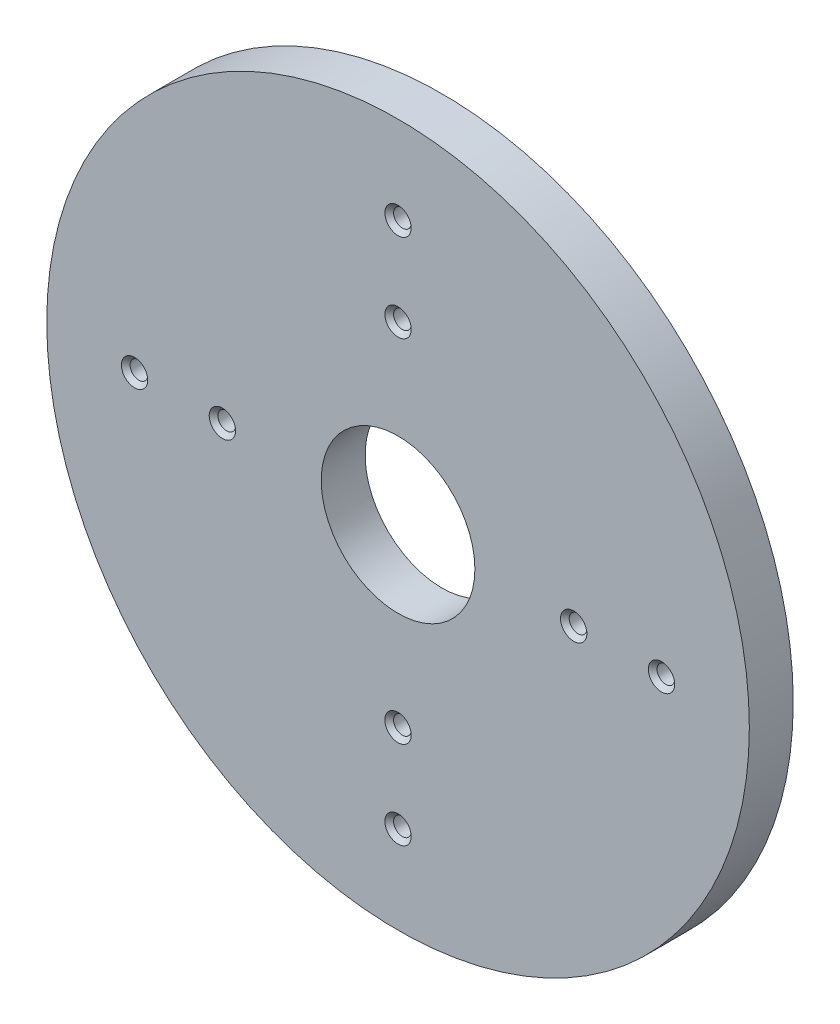
ISO-10303-21;
HEADER;
FILE_DESCRIPTION(('STEP AP214'),'2;1');
FILE_NAME('part.step','',(''),(''),'','','');
FILE_SCHEMA(('AUTOMOTIVE_DESIGN { 1 0 10303 214 1 1 1 1 }'));
ENDSEC;
DATA;
#1=APPLICATION_CONTEXT('core data for automotive mechanical design processes');
#2=APPLICATION_PROTOCOL_DEFINITION('international standard','automotive_design',2000,#1);
#3=PRODUCT_CONTEXT('',#1,'mechanical');
#4=PRODUCT('Part','Part','',(#3));
#5=PRODUCT_RELATED_PRODUCT_CATEGORY('part','',(#4));
#6=PRODUCT_DEFINITION_FORMATION('','',#4);
#7=PRODUCT_DEFINITION_CONTEXT('part definition',#1,'design');
#8=PRODUCT_DEFINITION('design','',#6,#7);
#9=PRODUCT_DEFINITION_SHAPE('','',#8);
#10=(LENGTH_UNIT() NAMED_UNIT(*) SI_UNIT(.MILLI.,.METRE.));
#11=(NAMED_UNIT(*) PLANE_ANGLE_UNIT() SI_UNIT($,.RADIAN.));
#12=(NAMED_UNIT(*) SI_UNIT($,.STERADIAN.) SOLID_ANGLE_UNIT());
#13=UNCERTAINTY_MEASURE_WITH_UNIT(LENGTH_MEASURE(1.E-05),#10,'distance_accuracy_value','');
#14=(GEOMETRIC_REPRESENTATION_CONTEXT(3) GLOBAL_UNCERTAINTY_ASSIGNED_CONTEXT((#13)) GLOBAL_UNIT_ASSIGNED_CONTEXT((#10,
#11,#12)) REPRESENTATION_CONTEXT('',''));
#15=CARTESIAN_POINT('',(0.,0.,0.));
#16=DIRECTION('',(0.,0.,1.));
#17=DIRECTION('',(1.,0.,0.));
#18=AXIS2_PLACEMENT_3D('',#15,#16,#17);
#19=CARTESIAN_POINT('',(0.,0.,12.7));
#20=DIRECTION('',(0.,0.,1.));
#21=DIRECTION('',(1.,0.,0.));
#22=AXIS2_PLACEMENT_3D('',#19,#20,#21);
#23=PLANE('',#22);
#24=CARTESIAN_POINT('',(0.,76.2,12.7));
#25=DIRECTION('',(0.,0.,1.));
#26=DIRECTION('',(1.,0.,0.));
#27=AXIS2_PLACEMENT_3D('',#24,#25,#26);
#28=CIRCLE('',#27,3.81);
#29=CARTESIAN_POINT('',(3.81,76.2,12.7));
#30=VERTEX_POINT('',#29);
#31=EDGE_CURVE('E143',#30,#30,#28,.T.);
#32=ORIENTED_EDGE('',*,*,#31,.F.);
#33=EDGE_LOOP('',(#32));
#34=FACE_BOUND('',#33,.T.);
#35=CARTESIAN_POINT('',(0.,50.8,12.7));
#36=DIRECTION('',(0.,0.,1.));
#37=DIRECTION('',(1.,0.,0.));
#38=AXIS2_PLACEMENT_3D('',#35,#36,#37);
#39=CIRCLE('',#38,3.81);
#40=CARTESIAN_POINT('',(3.81,50.8,12.7));
#41=VERTEX_POINT('',#40);
#42=EDGE_CURVE('E131',#41,#41,#39,.T.);
#43=ORIENTED_EDGE('',*,*,#42,.F.);
#44=EDGE_LOOP('',(#43));
#45=FACE_BOUND('',#44,.T.);
#46=CARTESIAN_POINT('',(76.2000000000014,1.43604633188994E-12,12.7));
#47=DIRECTION('',(0.,0.,1.));
#48=DIRECTION('',(1.,0.,0.));
#49=AXIS2_PLACEMENT_3D('',#46,#47,#48);
#50=CIRCLE('',#49,3.80999999999999);
#51=CARTESIAN_POINT('',(80.0100000000014,1.43604633188994E-12,12.7));
#52=VERTEX_POINT('',#51);
#53=EDGE_CURVE('E119',#52,#52,#50,.T.);
#54=ORIENTED_EDGE('',*,*,#53,.F.);
#55=EDGE_LOOP('',(#54));
#56=FACE_BOUND('',#55,.T.);
#57=CARTESIAN_POINT('',(50.8000000000014,1.43449103045502E-12,12.7));
#58=DIRECTION('',(0.,0.,1.));
#59=DIRECTION('',(1.,0.,0.));
#60=AXIS2_PLACEMENT_3D('',#57,#58,#59);
#61=CIRCLE('',#60,3.81);
#62=CARTESIAN_POINT('',(54.6100000000014,1.43449103045502E-12,12.7));
#63=VERTEX_POINT('',#62);
#64=EDGE_CURVE('E107',#63,#63,#61,.T.);
#65=ORIENTED_EDGE('',*,*,#64,.F.);
#66=EDGE_LOOP('',(#65));
#67=FACE_BOUND('',#66,.T.);
#68=CARTESIAN_POINT('',(2.87209266377988E-12,-76.2,12.7));
#69=DIRECTION('',(0.,0.,1.));
#70=DIRECTION('',(1.,0.,0.));
#71=AXIS2_PLACEMENT_3D('',#68,#69,#70);
#72=CIRCLE('',#71,3.81);
#73=CARTESIAN_POINT('',(3.81000000000287,-76.2,12.7));
#74=VERTEX_POINT('',#73);
#75=EDGE_CURVE('E95',#74,#74,#72,.T.);
#76=ORIENTED_EDGE('',*,*,#75,.F.);
#77=EDGE_LOOP('',(#76));
#78=FACE_BOUND('',#77,.T.);
#79=CARTESIAN_POINT('',(2.86898206091004E-12,-50.8,12.7));
#80=DIRECTION('',(0.,0.,1.));
#81=DIRECTION('',(1.,0.,0.));
#82=AXIS2_PLACEMENT_3D('',#79,#80,#81);
#83=CIRCLE('',#82,3.81);
#84=CARTESIAN_POINT('',(3.81000000000287,-50.8,12.7));
#85=VERTEX_POINT('',#84);
#86=EDGE_CURVE('E83',#85,#85,#83,.T.);
#87=ORIENTED_EDGE('',*,*,#86,.F.);
#88=EDGE_LOOP('',(#87));
#89=FACE_BOUND('',#88,.T.);
#90=CARTESIAN_POINT('',(-76.1999999999986,-1.42671452328043E-12,12.7));
#91=DIRECTION('',(0.,0.,1.));
#92=DIRECTION('',(1.,0.,0.));
#93=AXIS2_PLACEMENT_3D('',#90,#91,#92);
#94=CIRCLE('',#93,3.80999999999999);
#95=CARTESIAN_POINT('',(-72.3899999999986,-1.42671452328043E-12,12.7));
#96=VERTEX_POINT('',#95);
#97=EDGE_CURVE('E71',#96,#96,#94,.T.);
#98=ORIENTED_EDGE('',*,*,#97,.F.);
#99=EDGE_LOOP('',(#98));
#100=FACE_BOUND('',#99,.T.);
#101=CARTESIAN_POINT('',(-50.7999999999986,-1.42826982471535E-12,12.7));
#102=DIRECTION('',(0.,0.,1.));
#103=DIRECTION('',(1.,0.,0.));
#104=AXIS2_PLACEMENT_3D('',#101,#102,#103);
#105=CIRCLE('',#104,3.81);
#106=CARTESIAN_POINT('',(-46.9899999999986,-1.42826982471535E-12,12.7));
#107=VERTEX_POINT('',#106);
#108=EDGE_CURVE('E59',#107,#107,#105,.T.);
#109=ORIENTED_EDGE('',*,*,#108,.F.);
#110=EDGE_LOOP('',(#109));
#111=FACE_BOUND('',#110,.T.);
#112=CARTESIAN_POINT('',(0.,0.,12.7));
#113=DIRECTION('',(0.,0.,1.));
#114=DIRECTION('',(1.,0.,0.));
#115=AXIS2_PLACEMENT_3D('',#112,#113,#114);
#116=CIRCLE('',#115,101.6);
#117=CARTESIAN_POINT('',(101.6,0.,12.7));
#118=VERTEX_POINT('',#117);
#119=EDGE_CURVE('E10',#118,#118,#116,.T.);
#120=ORIENTED_EDGE('',*,*,#119,.T.);
#121=EDGE_LOOP('',(#120));
#122=FACE_BOUND('',#121,.T.);
#123=CARTESIAN_POINT('',(0.,0.,12.7));
#124=DIRECTION('',(0.,0.,1.));
#125=DIRECTION('',(1.,0.,0.));
#126=AXIS2_PLACEMENT_3D('',#123,#124,#125);
#127=CIRCLE('',#126,22.225);
#128=CARTESIAN_POINT('',(22.225,0.,12.7));
#129=VERTEX_POINT('',#128);
#130=EDGE_CURVE('E46',#129,#129,#127,.T.);
#131=ORIENTED_EDGE('',*,*,#130,.F.);
#132=EDGE_LOOP('',(#131));
#133=FACE_BOUND('',#132,.T.);
#134=ADVANCED_FACE('F35',(#34,#45,#56,#67,#78,#89,#100,#111,#122,#133),#23,.T.);
#135=CARTESIAN_POINT('',(0.,0.,0.));
#136=DIRECTION('',(0.,0.,1.));
#137=DIRECTION('',(1.,0.,0.));
#138=AXIS2_PLACEMENT_3D('',#135,#136,#137);
#139=PLANE('',#138);
#140=CARTESIAN_POINT('',(0.,76.2,0.));
#141=DIRECTION('',(0.,0.,1.));
#142=DIRECTION('',(1.,0.,0.));
#143=AXIS2_PLACEMENT_3D('',#140,#141,#142);
#144=CIRCLE('',#143,3.81);
#145=CARTESIAN_POINT('',(3.81,76.2,0.));
#146=VERTEX_POINT('',#145);
#147=EDGE_CURVE('E146',#146,#146,#144,.T.);
#148=ORIENTED_EDGE('',*,*,#147,.T.);
#149=EDGE_LOOP('',(#148));
#150=FACE_BOUND('',#149,.T.);
#151=CARTESIAN_POINT('',(0.,50.8,0.));
#152=DIRECTION('',(0.,0.,1.));
#153=DIRECTION('',(1.,0.,0.));
#154=AXIS2_PLACEMENT_3D('',#151,#152,#153);
#155=CIRCLE('',#154,3.81);
#156=CARTESIAN_POINT('',(3.81,50.8,0.));
#157=VERTEX_POINT('',#156);
#158=EDGE_CURVE('E134',#157,#157,#155,.T.);
#159=ORIENTED_EDGE('',*,*,#158,.T.);
#160=EDGE_LOOP('',(#159));
#161=FACE_BOUND('',#160,.T.);
#162=CARTESIAN_POINT('',(76.2000000000014,1.43604633188994E-12,0.));
#163=DIRECTION('',(0.,0.,1.));
#164=DIRECTION('',(1.,0.,0.));
#165=AXIS2_PLACEMENT_3D('',#162,#163,#164);
#166=CIRCLE('',#165,3.80999999999999);
#167=CARTESIAN_POINT('',(80.0100000000014,1.43604633188994E-12,0.));
#168=VERTEX_POINT('',#167);
#169=EDGE_CURVE('E122',#168,#168,#166,.T.);
#170=ORIENTED_EDGE('',*,*,#169,.T.);
#171=EDGE_LOOP('',(#170));
#172=FACE_BOUND('',#171,.T.);
#173=CARTESIAN_POINT('',(50.8000000000014,1.43449103045502E-12,0.));
#174=DIRECTION('',(0.,0.,1.));
#175=DIRECTION('',(1.,0.,0.));
#176=AXIS2_PLACEMENT_3D('',#173,#174,#175);
#177=CIRCLE('',#176,3.80999999999999);
#178=CARTESIAN_POINT('',(54.6100000000014,1.43449103045502E-12,0.));
#179=VERTEX_POINT('',#178);
#180=EDGE_CURVE('E110',#179,#179,#177,.T.);
#181=ORIENTED_EDGE('',*,*,#180,.T.);
#182=EDGE_LOOP('',(#181));
#183=FACE_BOUND('',#182,.T.);
#184=CARTESIAN_POINT('',(2.87209266377988E-12,-76.2,0.));
#185=DIRECTION('',(0.,0.,1.));
#186=DIRECTION('',(1.,0.,0.));
#187=AXIS2_PLACEMENT_3D('',#184,#185,#186);
#188=CIRCLE('',#187,3.81);
#189=CARTESIAN_POINT('',(3.81000000000287,-76.2,0.));
#190=VERTEX_POINT('',#189);
#191=EDGE_CURVE('E98',#190,#190,#188,.T.);
#192=ORIENTED_EDGE('',*,*,#191,.T.);
#193=EDGE_LOOP('',(#192));
#194=FACE_BOUND('',#193,.T.);
#195=CARTESIAN_POINT('',(2.86898206091004E-12,-50.8,0.));
#196=DIRECTION('',(0.,0.,1.));
#197=DIRECTION('',(1.,0.,0.));
#198=AXIS2_PLACEMENT_3D('',#195,#196,#197);
#199=CIRCLE('',#198,3.81);
#200=CARTESIAN_POINT('',(3.81000000000287,-50.8,0.));
#201=VERTEX_POINT('',#200);
#202=EDGE_CURVE('E86',#201,#201,#199,.T.);
#203=ORIENTED_EDGE('',*,*,#202,.T.);
#204=EDGE_LOOP('',(#203));
#205=FACE_BOUND('',#204,.T.);
#206=CARTESIAN_POINT('',(-76.1999999999986,-1.42671452328043E-12,0.));
#207=DIRECTION('',(0.,0.,1.));
#208=DIRECTION('',(1.,0.,0.));
#209=AXIS2_PLACEMENT_3D('',#206,#207,#208);
#210=CIRCLE('',#209,3.80999999999999);
#211=CARTESIAN_POINT('',(-72.3899999999986,-1.42671452328043E-12,0.));
#212=VERTEX_POINT('',#211);
#213=EDGE_CURVE('E74',#212,#212,#210,.T.);
#214=ORIENTED_EDGE('',*,*,#213,.T.);
#215=EDGE_LOOP('',(#214));
#216=FACE_BOUND('',#215,.T.);
#217=CARTESIAN_POINT('',(-50.7999999999986,-1.42826982471535E-12,0.));
#218=DIRECTION('',(0.,0.,1.));
#219=DIRECTION('',(1.,0.,0.));
#220=AXIS2_PLACEMENT_3D('',#217,#218,#219);
#221=CIRCLE('',#220,3.80999999999999);
#222=CARTESIAN_POINT('',(-46.9899999999986,-1.42826982471535E-12,0.));
#223=VERTEX_POINT('',#222);
#224=EDGE_CURVE('E62',#223,#223,#221,.T.);
#225=ORIENTED_EDGE('',*,*,#224,.T.);
#226=EDGE_LOOP('',(#225));
#227=FACE_BOUND('',#226,.T.);
#228=CARTESIAN_POINT('',(0.,0.,0.));
#229=DIRECTION('',(0.,0.,1.));
#230=DIRECTION('',(1.,0.,0.));
#231=AXIS2_PLACEMENT_3D('',#228,#229,#230);
#232=CIRCLE('',#231,101.6);
#233=CARTESIAN_POINT('',(101.6,0.,0.));
#234=VERTEX_POINT('',#233);
#235=EDGE_CURVE('E39',#234,#234,#232,.T.);
#236=ORIENTED_EDGE('',*,*,#235,.F.);
#237=EDGE_LOOP('',(#236));
#238=FACE_BOUND('',#237,.T.);
#239=CARTESIAN_POINT('',(0.,0.,0.));
#240=DIRECTION('',(0.,0.,1.));
#241=DIRECTION('',(1.,0.,0.));
#242=AXIS2_PLACEMENT_3D('',#239,#240,#241);
#243=CIRCLE('',#242,22.225);
#244=CARTESIAN_POINT('',(22.225,0.,0.));
#245=VERTEX_POINT('',#244);
#246=EDGE_CURVE('E48',#245,#245,#243,.T.);
#247=ORIENTED_EDGE('',*,*,#246,.T.);
#248=EDGE_LOOP('',(#247));
#249=FACE_BOUND('',#248,.T.);
#250=ADVANCED_FACE('F150',(#150,#161,#172,#183,#194,#205,#216,#227,#238,#249),#139,.F.);
#251=CARTESIAN_POINT('',(0.,0.,12.7));
#252=DIRECTION('',(0.,0.,-1.));
#253=DIRECTION('',(-1.,0.,0.));
#254=AXIS2_PLACEMENT_3D('',#251,#252,#253);
#255=CYLINDRICAL_SURFACE('',#254,101.6);
#256=ORIENTED_EDGE('',*,*,#119,.F.);
#257=EDGE_LOOP('',(#256));
#258=FACE_BOUND('',#257,.T.);
#259=ORIENTED_EDGE('',*,*,#235,.T.);
#260=EDGE_LOOP('',(#259));
#261=FACE_BOUND('',#260,.T.);
#262=ADVANCED_FACE('F37',(#258,#261),#255,.T.);
#263=CARTESIAN_POINT('',(0.,0.,12.7));
#264=DIRECTION('',(0.,0.,-1.));
#265=DIRECTION('',(-1.,0.,0.));
#266=AXIS2_PLACEMENT_3D('',#263,#264,#265);
#267=CYLINDRICAL_SURFACE('',#266,22.225);
#268=ORIENTED_EDGE('',*,*,#130,.T.);
#269=EDGE_LOOP('',(#268));
#270=FACE_BOUND('',#269,.T.);
#271=ORIENTED_EDGE('',*,*,#246,.F.);
#272=EDGE_LOOP('',(#271));
#273=FACE_BOUND('',#272,.T.);
#274=ADVANCED_FACE('F191',(#270,#273),#267,.F.);
#275=CARTESIAN_POINT('',(-50.7999999999986,-1.42826982471535E-12,1.2573));
#276=DIRECTION('',(0.,0.,-1.));
#277=DIRECTION('',(-1.,0.,0.));
#278=AXIS2_PLACEMENT_3D('',#275,#276,#277);
#279=CONICAL_SURFACE('',#278,2.5527,0.785398163397446);
#280=ORIENTED_EDGE('',*,*,#224,.F.);
#281=EDGE_LOOP('',(#280));
#282=FACE_BOUND('',#281,.T.);
#283=CARTESIAN_POINT('',(-50.7999999999986,-1.42826982471535E-12,1.2573));
#284=DIRECTION('',(0.,0.,1.));
#285=DIRECTION('',(1.,0.,0.));
#286=AXIS2_PLACEMENT_3D('',#283,#284,#285);
#287=CIRCLE('',#286,2.5527);
#288=CARTESIAN_POINT('',(-48.2472999999986,-1.42826982471535E-12,1.2573));
#289=VERTEX_POINT('',#288);
#290=EDGE_CURVE('E51',#289,#289,#287,.T.);
#291=ORIENTED_EDGE('',*,*,#290,.T.);
#292=EDGE_LOOP('',(#291));
#293=FACE_BOUND('',#292,.T.);
#294=ADVANCED_FACE('F194',(#282,#293),#279,.F.);
#295=CARTESIAN_POINT('',(-50.7999999999986,-1.42826982471535E-12,12.7));
#296=DIRECTION('',(0.,0.,1.));
#297=DIRECTION('',(1.,0.,0.));
#298=AXIS2_PLACEMENT_3D('',#295,#296,#297);
#299=CYLINDRICAL_SURFACE('',#298,2.5527);
#300=ORIENTED_EDGE('',*,*,#290,.F.);
#301=EDGE_LOOP('',(#300));
#302=FACE_BOUND('',#301,.T.);
#303=CARTESIAN_POINT('',(-50.7999999999986,-1.42826982471535E-12,11.4427));
#304=DIRECTION('',(0.,0.,1.));
#305=DIRECTION('',(1.,0.,0.));
#306=AXIS2_PLACEMENT_3D('',#303,#304,#305);
#307=CIRCLE('',#306,2.5527);
#308=CARTESIAN_POINT('',(-48.2472999999986,-1.42826982471535E-12,11.4427));
#309=VERTEX_POINT('',#308);
#310=EDGE_CURVE('E56',#309,#309,#307,.T.);
#311=ORIENTED_EDGE('',*,*,#310,.T.);
#312=EDGE_LOOP('',(#311));
#313=FACE_BOUND('',#312,.T.);
#314=ADVANCED_FACE('F206',(#302,#313),#299,.F.);
#315=CARTESIAN_POINT('',(-50.7999999999986,-1.42826982471535E-12,12.7));
#316=DIRECTION('',(0.,0.,1.));
#317=DIRECTION('',(1.,0.,0.));
#318=AXIS2_PLACEMENT_3D('',#315,#316,#317);
#319=CONICAL_SURFACE('',#318,3.81,0.785398163397448);
#320=ORIENTED_EDGE('',*,*,#310,.F.);
#321=EDGE_LOOP('',(#320));
#322=FACE_BOUND('',#321,.T.);
#323=ORIENTED_EDGE('',*,*,#108,.T.);
#324=EDGE_LOOP('',(#323));
#325=FACE_BOUND('',#324,.T.);
#326=ADVANCED_FACE('F210',(#322,#325),#319,.F.);
#327=CARTESIAN_POINT('',(-76.1999999999986,-1.42671452328043E-12,1.2573));
#328=DIRECTION('',(0.,0.,-1.));
#329=DIRECTION('',(-1.,0.,0.));
#330=AXIS2_PLACEMENT_3D('',#327,#328,#329);
#331=CONICAL_SURFACE('',#330,2.55269999999999,0.785398163397448);
#332=ORIENTED_EDGE('',*,*,#213,.F.);
#333=EDGE_LOOP('',(#332));
#334=FACE_BOUND('',#333,.T.);
#335=CARTESIAN_POINT('',(-76.1999999999986,-1.42671452328043E-12,1.2573));
#336=DIRECTION('',(0.,0.,1.));
#337=DIRECTION('',(1.,0.,0.));
#338=AXIS2_PLACEMENT_3D('',#335,#336,#337);
#339=CIRCLE('',#338,2.55269999999999);
#340=CARTESIAN_POINT('',(-73.6472999999986,-1.42671452328043E-12,1.2573));
#341=VERTEX_POINT('',#340);
#342=EDGE_CURVE('E65',#341,#341,#339,.T.);
#343=ORIENTED_EDGE('',*,*,#342,.T.);
#344=EDGE_LOOP('',(#343));
#345=FACE_BOUND('',#344,.T.);
#346=ADVANCED_FACE('F214',(#334,#345),#331,.F.);
#347=CARTESIAN_POINT('',(-76.1999999999986,-1.42671452328043E-12,12.7));
#348=DIRECTION('',(0.,0.,1.));
#349=DIRECTION('',(1.,0.,0.));
#350=AXIS2_PLACEMENT_3D('',#347,#348,#349);
#351=CYLINDRICAL_SURFACE('',#350,2.5527);
#352=ORIENTED_EDGE('',*,*,#342,.F.);
#353=EDGE_LOOP('',(#352));
#354=FACE_BOUND('',#353,.T.);
#355=CARTESIAN_POINT('',(-76.1999999999986,-1.42671452328043E-12,11.4427));
#356=DIRECTION('',(0.,0.,1.));
#357=DIRECTION('',(1.,0.,0.));
#358=AXIS2_PLACEMENT_3D('',#355,#356,#357);
#359=CIRCLE('',#358,2.55270000000001);
#360=CARTESIAN_POINT('',(-73.6472999999986,-1.42671452328043E-12,11.4427));
#361=VERTEX_POINT('',#360);
#362=EDGE_CURVE('E68',#361,#361,#359,.T.);
#363=ORIENTED_EDGE('',*,*,#362,.T.);
#364=EDGE_LOOP('',(#363));
#365=FACE_BOUND('',#364,.T.);
#366=ADVANCED_FACE('F218',(#354,#365),#351,.F.);
#367=CARTESIAN_POINT('',(-76.1999999999986,-1.42671452328043E-12,12.7));
#368=DIRECTION('',(0.,0.,1.));
#369=DIRECTION('',(1.,0.,0.));
#370=AXIS2_PLACEMENT_3D('',#367,#368,#369);
#371=CONICAL_SURFACE('',#370,3.80999999999999,0.785398163397443);
#372=ORIENTED_EDGE('',*,*,#362,.F.);
#373=EDGE_LOOP('',(#372));
#374=FACE_BOUND('',#373,.T.);
#375=ORIENTED_EDGE('',*,*,#97,.T.);
#376=EDGE_LOOP('',(#375));
#377=FACE_BOUND('',#376,.T.);
#378=ADVANCED_FACE('F222',(#374,#377),#371,.F.);
#379=CARTESIAN_POINT('',(2.86898206091004E-12,-50.8,1.2573));
#380=DIRECTION('',(0.,0.,-1.));
#381=DIRECTION('',(-1.,0.,0.));
#382=AXIS2_PLACEMENT_3D('',#379,#380,#381);
#383=CONICAL_SURFACE('',#382,2.5527,0.785398163397447);
#384=ORIENTED_EDGE('',*,*,#202,.F.);
#385=EDGE_LOOP('',(#384));
#386=FACE_BOUND('',#385,.T.);
#387=CARTESIAN_POINT('',(2.86898206091004E-12,-50.8,1.2573));
#388=DIRECTION('',(0.,0.,1.));
#389=DIRECTION('',(1.,0.,0.));
#390=AXIS2_PLACEMENT_3D('',#387,#388,#389);
#391=CIRCLE('',#390,2.5527);
#392=CARTESIAN_POINT('',(2.55270000000287,-50.8,1.2573));
#393=VERTEX_POINT('',#392);
#394=EDGE_CURVE('E77',#393,#393,#391,.T.);
#395=ORIENTED_EDGE('',*,*,#394,.T.);
#396=EDGE_LOOP('',(#395));
#397=FACE_BOUND('',#396,.T.);
#398=ADVANCED_FACE('F226',(#386,#397),#383,.F.);
#399=CARTESIAN_POINT('',(2.86898206091004E-12,-50.8,12.7));
#400=DIRECTION('',(0.,0.,1.));
#401=DIRECTION('',(1.,0.,0.));
#402=AXIS2_PLACEMENT_3D('',#399,#400,#401);
#403=CYLINDRICAL_SURFACE('',#402,2.5527);
#404=ORIENTED_EDGE('',*,*,#394,.F.);
#405=EDGE_LOOP('',(#404));
#406=FACE_BOUND('',#405,.T.);
#407=CARTESIAN_POINT('',(2.86898206091004E-12,-50.8,11.4427));
#408=DIRECTION('',(0.,0.,1.));
#409=DIRECTION('',(1.,0.,0.));
#410=AXIS2_PLACEMENT_3D('',#407,#408,#409);
#411=CIRCLE('',#410,2.5527);
#412=CARTESIAN_POINT('',(2.55270000000287,-50.8,11.4427));
#413=VERTEX_POINT('',#412);
#414=EDGE_CURVE('E80',#413,#413,#411,.T.);
#415=ORIENTED_EDGE('',*,*,#414,.T.);
#416=EDGE_LOOP('',(#415));
#417=FACE_BOUND('',#416,.T.);
#418=ADVANCED_FACE('F230',(#406,#417),#403,.F.);
#419=CARTESIAN_POINT('',(2.86898206091004E-12,-50.8,12.7));
#420=DIRECTION('',(0.,0.,1.));
#421=DIRECTION('',(1.,0.,0.));
#422=AXIS2_PLACEMENT_3D('',#419,#420,#421);
#423=CONICAL_SURFACE('',#422,3.81,0.785398163397447);
#424=ORIENTED_EDGE('',*,*,#414,.F.);
#425=EDGE_LOOP('',(#424));
#426=FACE_BOUND('',#425,.T.);
#427=ORIENTED_EDGE('',*,*,#86,.T.);
#428=EDGE_LOOP('',(#427));
#429=FACE_BOUND('',#428,.T.);
#430=ADVANCED_FACE('F234',(#426,#429),#423,.F.);
#431=CARTESIAN_POINT('',(2.87209266377988E-12,-76.2,1.2573));
#432=DIRECTION('',(0.,0.,-1.));
#433=DIRECTION('',(-1.,0.,0.));
#434=AXIS2_PLACEMENT_3D('',#431,#432,#433);
#435=CONICAL_SURFACE('',#434,2.5527,0.785398163397447);
#436=ORIENTED_EDGE('',*,*,#191,.F.);
#437=EDGE_LOOP('',(#436));
#438=FACE_BOUND('',#437,.T.);
#439=CARTESIAN_POINT('',(2.87209266377988E-12,-76.2,1.2573));
#440=DIRECTION('',(0.,0.,1.));
#441=DIRECTION('',(1.,0.,0.));
#442=AXIS2_PLACEMENT_3D('',#439,#440,#441);
#443=CIRCLE('',#442,2.5527);
#444=CARTESIAN_POINT('',(2.55270000000287,-76.2,1.2573));
#445=VERTEX_POINT('',#444);
#446=EDGE_CURVE('E89',#445,#445,#443,.T.);
#447=ORIENTED_EDGE('',*,*,#446,.T.);
#448=EDGE_LOOP('',(#447));
#449=FACE_BOUND('',#448,.T.);
#450=ADVANCED_FACE('F238',(#438,#449),#435,.F.);
#451=CARTESIAN_POINT('',(2.87209266377988E-12,-76.2,12.7));
#452=DIRECTION('',(0.,0.,1.));
#453=DIRECTION('',(1.,0.,0.));
#454=AXIS2_PLACEMENT_3D('',#451,#452,#453);
#455=CYLINDRICAL_SURFACE('',#454,2.5527);
#456=ORIENTED_EDGE('',*,*,#446,.F.);
#457=EDGE_LOOP('',(#456));
#458=FACE_BOUND('',#457,.T.);
#459=CARTESIAN_POINT('',(2.87209266377988E-12,-76.2,11.4427));
#460=DIRECTION('',(0.,0.,1.));
#461=DIRECTION('',(1.,0.,0.));
#462=AXIS2_PLACEMENT_3D('',#459,#460,#461);
#463=CIRCLE('',#462,2.5527);
#464=CARTESIAN_POINT('',(2.55270000000287,-76.2,11.4427));
#465=VERTEX_POINT('',#464);
#466=EDGE_CURVE('E92',#465,#465,#463,.T.);
#467=ORIENTED_EDGE('',*,*,#466,.T.);
#468=EDGE_LOOP('',(#467));
#469=FACE_BOUND('',#468,.T.);
#470=ADVANCED_FACE('F242',(#458,#469),#455,.F.);
#471=CARTESIAN_POINT('',(2.87209266377988E-12,-76.2,12.7));
#472=DIRECTION('',(0.,0.,1.));
#473=DIRECTION('',(1.,0.,0.));
#474=AXIS2_PLACEMENT_3D('',#471,#472,#473);
#475=CONICAL_SURFACE('',#474,3.81,0.785398163397447);
#476=ORIENTED_EDGE('',*,*,#466,.F.);
#477=EDGE_LOOP('',(#476));
#478=FACE_BOUND('',#477,.T.);
#479=ORIENTED_EDGE('',*,*,#75,.T.);
#480=EDGE_LOOP('',(#479));
#481=FACE_BOUND('',#480,.T.);
#482=ADVANCED_FACE('F246',(#478,#481),#475,.F.);
#483=CARTESIAN_POINT('',(50.8000000000014,1.43449103045502E-12,1.2573));
#484=DIRECTION('',(0.,0.,-1.));
#485=DIRECTION('',(-1.,0.,0.));
#486=AXIS2_PLACEMENT_3D('',#483,#484,#485);
#487=CONICAL_SURFACE('',#486,2.5527,0.785398163397446);
#488=ORIENTED_EDGE('',*,*,#180,.F.);
#489=EDGE_LOOP('',(#488));
#490=FACE_BOUND('',#489,.T.);
#491=CARTESIAN_POINT('',(50.8000000000014,1.43449103045502E-12,1.2573));
#492=DIRECTION('',(0.,0.,1.));
#493=DIRECTION('',(1.,0.,0.));
#494=AXIS2_PLACEMENT_3D('',#491,#492,#493);
#495=CIRCLE('',#494,2.5527);
#496=CARTESIAN_POINT('',(53.3527000000014,1.43449103045502E-12,1.2573));
#497=VERTEX_POINT('',#496);
#498=EDGE_CURVE('E101',#497,#497,#495,.T.);
#499=ORIENTED_EDGE('',*,*,#498,.T.);
#500=EDGE_LOOP('',(#499));
#501=FACE_BOUND('',#500,.T.);
#502=ADVANCED_FACE('F250',(#490,#501),#487,.F.);
#503=CARTESIAN_POINT('',(50.8000000000014,1.43449103045502E-12,12.7));
#504=DIRECTION('',(0.,0.,1.));
#505=DIRECTION('',(1.,0.,0.));
#506=AXIS2_PLACEMENT_3D('',#503,#504,#505);
#507=CYLINDRICAL_SURFACE('',#506,2.5527);
#508=ORIENTED_EDGE('',*,*,#498,.F.);
#509=EDGE_LOOP('',(#508));
#510=FACE_BOUND('',#509,.T.);
#511=CARTESIAN_POINT('',(50.8000000000014,1.43449103045502E-12,11.4427));
#512=DIRECTION('',(0.,0.,1.));
#513=DIRECTION('',(1.,0.,0.));
#514=AXIS2_PLACEMENT_3D('',#511,#512,#513);
#515=CIRCLE('',#514,2.5527);
#516=CARTESIAN_POINT('',(53.3527000000014,1.43449103045502E-12,11.4427));
#517=VERTEX_POINT('',#516);
#518=EDGE_CURVE('E104',#517,#517,#515,.T.);
#519=ORIENTED_EDGE('',*,*,#518,.T.);
#520=EDGE_LOOP('',(#519));
#521=FACE_BOUND('',#520,.T.);
#522=ADVANCED_FACE('F254',(#510,#521),#507,.F.);
#523=CARTESIAN_POINT('',(50.8000000000014,1.43449103045502E-12,12.7));
#524=DIRECTION('',(0.,0.,1.));
#525=DIRECTION('',(1.,0.,0.));
#526=AXIS2_PLACEMENT_3D('',#523,#524,#525);
#527=CONICAL_SURFACE('',#526,3.81,0.785398163397448);
#528=ORIENTED_EDGE('',*,*,#518,.F.);
#529=EDGE_LOOP('',(#528));
#530=FACE_BOUND('',#529,.T.);
#531=ORIENTED_EDGE('',*,*,#64,.T.);
#532=EDGE_LOOP('',(#531));
#533=FACE_BOUND('',#532,.T.);
#534=ADVANCED_FACE('F258',(#530,#533),#527,.F.);
#535=CARTESIAN_POINT('',(76.2000000000014,1.43604633188994E-12,1.2573));
#536=DIRECTION('',(0.,0.,-1.));
#537=DIRECTION('',(-1.,0.,0.));
#538=AXIS2_PLACEMENT_3D('',#535,#536,#537);
#539=CONICAL_SURFACE('',#538,2.55269999999999,0.785398163397448);
#540=ORIENTED_EDGE('',*,*,#169,.F.);
#541=EDGE_LOOP('',(#540));
#542=FACE_BOUND('',#541,.T.);
#543=CARTESIAN_POINT('',(76.2000000000014,1.43604633188994E-12,1.2573));
#544=DIRECTION('',(0.,0.,1.));
#545=DIRECTION('',(1.,0.,0.));
#546=AXIS2_PLACEMENT_3D('',#543,#544,#545);
#547=CIRCLE('',#546,2.55269999999999);
#548=CARTESIAN_POINT('',(78.7527000000014,1.43604633188994E-12,1.2573));
#549=VERTEX_POINT('',#548);
#550=EDGE_CURVE('E113',#549,#549,#547,.T.);
#551=ORIENTED_EDGE('',*,*,#550,.T.);
#552=EDGE_LOOP('',(#551));
#553=FACE_BOUND('',#552,.T.);
#554=ADVANCED_FACE('F262',(#542,#553),#539,.F.);
#555=CARTESIAN_POINT('',(76.2000000000014,1.43604633188994E-12,12.7));
#556=DIRECTION('',(0.,0.,1.));
#557=DIRECTION('',(1.,0.,0.));
#558=AXIS2_PLACEMENT_3D('',#555,#556,#557);
#559=CYLINDRICAL_SURFACE('',#558,2.5527);
#560=ORIENTED_EDGE('',*,*,#550,.F.);
#561=EDGE_LOOP('',(#560));
#562=FACE_BOUND('',#561,.T.);
#563=CARTESIAN_POINT('',(76.2000000000014,1.43604633188994E-12,11.4427));
#564=DIRECTION('',(0.,0.,1.));
#565=DIRECTION('',(1.,0.,0.));
#566=AXIS2_PLACEMENT_3D('',#563,#564,#565);
#567=CIRCLE('',#566,2.55270000000001);
#568=CARTESIAN_POINT('',(78.7527000000014,1.43604633188994E-12,11.4427));
#569=VERTEX_POINT('',#568);
#570=EDGE_CURVE('E116',#569,#569,#567,.T.);
#571=ORIENTED_EDGE('',*,*,#570,.T.);
#572=EDGE_LOOP('',(#571));
#573=FACE_BOUND('',#572,.T.);
#574=ADVANCED_FACE('F266',(#562,#573),#559,.F.);
#575=CARTESIAN_POINT('',(76.2000000000014,1.43604633188994E-12,12.7));
#576=DIRECTION('',(0.,0.,1.));
#577=DIRECTION('',(1.,0.,0.));
#578=AXIS2_PLACEMENT_3D('',#575,#576,#577);
#579=CONICAL_SURFACE('',#578,3.80999999999999,0.785398163397443);
#580=ORIENTED_EDGE('',*,*,#570,.F.);
#581=EDGE_LOOP('',(#580));
#582=FACE_BOUND('',#581,.T.);
#583=ORIENTED_EDGE('',*,*,#53,.T.);
#584=EDGE_LOOP('',(#583));
#585=FACE_BOUND('',#584,.T.);
#586=ADVANCED_FACE('F270',(#582,#585),#579,.F.);
#587=CARTESIAN_POINT('',(0.,50.8,1.2573));
#588=DIRECTION('',(0.,0.,-1.));
#589=DIRECTION('',(-1.,0.,0.));
#590=AXIS2_PLACEMENT_3D('',#587,#588,#589);
#591=CONICAL_SURFACE('',#590,2.5527,0.785398163397447);
#592=ORIENTED_EDGE('',*,*,#158,.F.);
#593=EDGE_LOOP('',(#592));
#594=FACE_BOUND('',#593,.T.);
#595=CARTESIAN_POINT('',(0.,50.8,1.2573));
#596=DIRECTION('',(0.,0.,1.));
#597=DIRECTION('',(1.,0.,0.));
#598=AXIS2_PLACEMENT_3D('',#595,#596,#597);
#599=CIRCLE('',#598,2.5527);
#600=CARTESIAN_POINT('',(2.5527,50.8,1.2573));
#601=VERTEX_POINT('',#600);
#602=EDGE_CURVE('E125',#601,#601,#599,.T.);
#603=ORIENTED_EDGE('',*,*,#602,.T.);
#604=EDGE_LOOP('',(#603));
#605=FACE_BOUND('',#604,.T.);
#606=ADVANCED_FACE('F274',(#594,#605),#591,.F.);
#607=CARTESIAN_POINT('',(0.,50.8,12.7));
#608=DIRECTION('',(0.,0.,1.));
#609=DIRECTION('',(1.,0.,0.));
#610=AXIS2_PLACEMENT_3D('',#607,#608,#609);
#611=CYLINDRICAL_SURFACE('',#610,2.5527);
#612=ORIENTED_EDGE('',*,*,#602,.F.);
#613=EDGE_LOOP('',(#612));
#614=FACE_BOUND('',#613,.T.);
#615=CARTESIAN_POINT('',(0.,50.8,11.4427));
#616=DIRECTION('',(0.,0.,1.));
#617=DIRECTION('',(1.,0.,0.));
#618=AXIS2_PLACEMENT_3D('',#615,#616,#617);
#619=CIRCLE('',#618,2.5527);
#620=CARTESIAN_POINT('',(2.5527,50.8,11.4427));
#621=VERTEX_POINT('',#620);
#622=EDGE_CURVE('E128',#621,#621,#619,.T.);
#623=ORIENTED_EDGE('',*,*,#622,.T.);
#624=EDGE_LOOP('',(#623));
#625=FACE_BOUND('',#624,.T.);
#626=ADVANCED_FACE('F278',(#614,#625),#611,.F.);
#627=CARTESIAN_POINT('',(0.,50.8,12.7));
#628=DIRECTION('',(0.,0.,1.));
#629=DIRECTION('',(1.,0.,0.));
#630=AXIS2_PLACEMENT_3D('',#627,#628,#629);
#631=CONICAL_SURFACE('',#630,3.81,0.785398163397447);
#632=ORIENTED_EDGE('',*,*,#622,.F.);
#633=EDGE_LOOP('',(#632));
#634=FACE_BOUND('',#633,.T.);
#635=ORIENTED_EDGE('',*,*,#42,.T.);
#636=EDGE_LOOP('',(#635));
#637=FACE_BOUND('',#636,.T.);
#638=ADVANCED_FACE('F157',(#634,#637),#631,.F.);
#639=CARTESIAN_POINT('',(0.,76.2,1.2573));
#640=DIRECTION('',(0.,0.,-1.));
#641=DIRECTION('',(-1.,0.,0.));
#642=AXIS2_PLACEMENT_3D('',#639,#640,#641);
#643=CONICAL_SURFACE('',#642,2.5527,0.785398163397447);
#644=ORIENTED_EDGE('',*,*,#147,.F.);
#645=EDGE_LOOP('',(#644));
#646=FACE_BOUND('',#645,.T.);
#647=CARTESIAN_POINT('',(0.,76.2,1.2573));
#648=DIRECTION('',(0.,0.,1.));
#649=DIRECTION('',(1.,0.,0.));
#650=AXIS2_PLACEMENT_3D('',#647,#648,#649);
#651=CIRCLE('',#650,2.5527);
#652=CARTESIAN_POINT('',(2.5527,76.2,1.2573));
#653=VERTEX_POINT('',#652);
#654=EDGE_CURVE('E137',#653,#653,#651,.T.);
#655=ORIENTED_EDGE('',*,*,#654,.T.);
#656=EDGE_LOOP('',(#655));
#657=FACE_BOUND('',#656,.T.);
#658=ADVANCED_FACE('F153',(#646,#657),#643,.F.);
#659=CARTESIAN_POINT('',(0.,76.2,12.7));
#660=DIRECTION('',(0.,0.,1.));
#661=DIRECTION('',(1.,0.,0.));
#662=AXIS2_PLACEMENT_3D('',#659,#660,#661);
#663=CYLINDRICAL_SURFACE('',#662,2.5527);
#664=ORIENTED_EDGE('',*,*,#654,.F.);
#665=EDGE_LOOP('',(#664));
#666=FACE_BOUND('',#665,.T.);
#667=CARTESIAN_POINT('',(0.,76.2,11.4427));
#668=DIRECTION('',(0.,0.,1.));
#669=DIRECTION('',(1.,0.,0.));
#670=AXIS2_PLACEMENT_3D('',#667,#668,#669);
#671=CIRCLE('',#670,2.5527);
#672=CARTESIAN_POINT('',(2.5527,76.2,11.4427));
#673=VERTEX_POINT('',#672);
#674=EDGE_CURVE('E140',#673,#673,#671,.T.);
#675=ORIENTED_EDGE('',*,*,#674,.T.);
#676=EDGE_LOOP('',(#675));
#677=FACE_BOUND('',#676,.T.);
#678=ADVANCED_FACE('F156',(#666,#677),#663,.F.);
#679=CARTESIAN_POINT('',(0.,76.2,12.7));
#680=DIRECTION('',(0.,0.,1.));
#681=DIRECTION('',(1.,0.,0.));
#682=AXIS2_PLACEMENT_3D('',#679,#680,#681);
#683=CONICAL_SURFACE('',#682,3.81,0.785398163397447);
#684=ORIENTED_EDGE('',*,*,#674,.F.);
#685=EDGE_LOOP('',(#684));
#686=FACE_BOUND('',#685,.T.);
#687=ORIENTED_EDGE('',*,*,#31,.T.);
#688=EDGE_LOOP('',(#687));
#689=FACE_BOUND('',#688,.T.);
#690=ADVANCED_FACE('F163',(#686,#689),#683,.F.);
#691=CLOSED_SHELL('',(#134,#250,#262,#274,#294,#314,#326,#346,#366,#378,#398,#418,#430,#450,
#470,#482,#502,#522,#534,#554,#574,#586,#606,#626,#638,#658,#678,#690));
#692=MANIFOLD_SOLID_BREP('B2',#691);
#693=ADVANCED_BREP_SHAPE_REPRESENTATION('',(#18,#692),#14);
#694=SHAPE_DEFINITION_REPRESENTATION(#9,#693);
ENDSEC;
END-ISO-10303-21;
